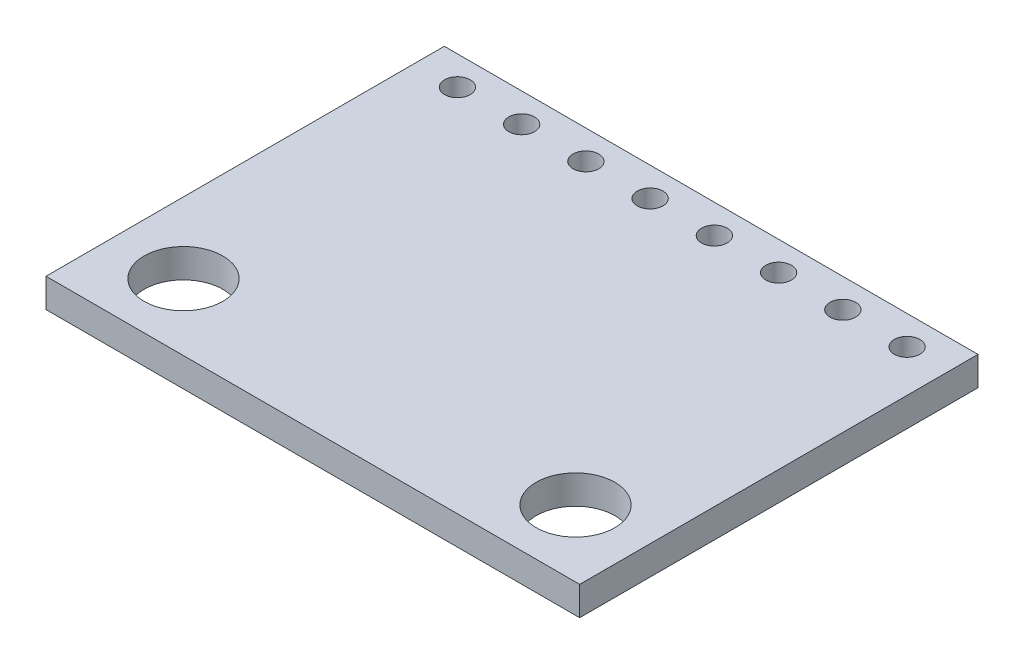
ISO-10303-21;
HEADER;
FILE_DESCRIPTION(('STEP AP214'),'2;1');
FILE_NAME('part.step','',(''),(''),'','','');
FILE_SCHEMA(('AUTOMOTIVE_DESIGN { 1 0 10303 214 1 1 1 1 }'));
ENDSEC;
DATA;
#1=APPLICATION_CONTEXT('core data for automotive mechanical design processes');
#2=APPLICATION_PROTOCOL_DEFINITION('international standard','automotive_design',2000,#1);
#3=PRODUCT_CONTEXT('',#1,'mechanical');
#4=PRODUCT('Part','Part','',(#3));
#5=PRODUCT_RELATED_PRODUCT_CATEGORY('part','',(#4));
#6=PRODUCT_DEFINITION_FORMATION('','',#4);
#7=PRODUCT_DEFINITION_CONTEXT('part definition',#1,'design');
#8=PRODUCT_DEFINITION('design','',#6,#7);
#9=PRODUCT_DEFINITION_SHAPE('','',#8);
#10=(LENGTH_UNIT() NAMED_UNIT(*) SI_UNIT(.MILLI.,.METRE.));
#11=(NAMED_UNIT(*) PLANE_ANGLE_UNIT() SI_UNIT($,.RADIAN.));
#12=(NAMED_UNIT(*) SI_UNIT($,.STERADIAN.) SOLID_ANGLE_UNIT());
#13=UNCERTAINTY_MEASURE_WITH_UNIT(LENGTH_MEASURE(1.E-05),#10,'distance_accuracy_value','');
#14=(GEOMETRIC_REPRESENTATION_CONTEXT(3) GLOBAL_UNCERTAINTY_ASSIGNED_CONTEXT((#13)) GLOBAL_UNIT_ASSIGNED_CONTEXT((#10,
#11,#12)) REPRESENTATION_CONTEXT('',''));
#15=CARTESIAN_POINT('',(0.,0.,0.));
#16=DIRECTION('',(0.,0.,1.));
#17=DIRECTION('',(1.,0.,0.));
#18=AXIS2_PLACEMENT_3D('',#15,#16,#17);
#19=CARTESIAN_POINT('',(0.,0.5715,0.));
#20=DIRECTION('',(0.,-1.,0.));
#21=DIRECTION('',(0.,0.,-1.));
#22=AXIS2_PLACEMENT_3D('',#19,#20,#21);
#23=PLANE('',#22);
#24=CARTESIAN_POINT('',(6.35,0.5715,-6.731));
#25=DIRECTION('',(0.,1.,0.));
#26=DIRECTION('',(0.,0.,1.));
#27=AXIS2_PLACEMENT_3D('',#24,#25,#26);
#28=CIRCLE('',#27,0.508);
#29=CARTESIAN_POINT('',(6.35,0.5715,-6.223));
#30=VERTEX_POINT('',#29);
#31=EDGE_CURVE('E160',#30,#30,#28,.T.);
#32=ORIENTED_EDGE('',*,*,#31,.F.);
#33=EDGE_LOOP('',(#32));
#34=FACE_BOUND('',#33,.T.);
#35=CARTESIAN_POINT('',(1.27,0.5715,-6.731));
#36=DIRECTION('',(0.,1.,0.));
#37=DIRECTION('',(0.,0.,1.));
#38=AXIS2_PLACEMENT_3D('',#35,#36,#37);
#39=CIRCLE('',#38,0.508);
#40=CARTESIAN_POINT('',(1.27,0.5715,-6.223));
#41=VERTEX_POINT('',#40);
#42=EDGE_CURVE('E148',#41,#41,#39,.T.);
#43=ORIENTED_EDGE('',*,*,#42,.F.);
#44=EDGE_LOOP('',(#43));
#45=FACE_BOUND('',#44,.T.);
#46=CARTESIAN_POINT('',(-3.81,0.5715,-6.731));
#47=DIRECTION('',(0.,1.,0.));
#48=DIRECTION('',(0.,0.,1.));
#49=AXIS2_PLACEMENT_3D('',#46,#47,#48);
#50=CIRCLE('',#49,0.508);
#51=CARTESIAN_POINT('',(-3.81,0.5715,-6.223));
#52=VERTEX_POINT('',#51);
#53=EDGE_CURVE('E136',#52,#52,#50,.T.);
#54=ORIENTED_EDGE('',*,*,#53,.F.);
#55=EDGE_LOOP('',(#54));
#56=FACE_BOUND('',#55,.T.);
#57=CARTESIAN_POINT('',(-8.89,0.5715,-6.731));
#58=DIRECTION('',(0.,1.,0.));
#59=DIRECTION('',(0.,0.,1.));
#60=AXIS2_PLACEMENT_3D('',#57,#58,#59);
#61=CIRCLE('',#60,0.508);
#62=CARTESIAN_POINT('',(-8.89,0.5715,-6.223));
#63=VERTEX_POINT('',#62);
#64=EDGE_CURVE('E124',#63,#63,#61,.T.);
#65=ORIENTED_EDGE('',*,*,#64,.F.);
#66=EDGE_LOOP('',(#65));
#67=FACE_BOUND('',#66,.T.);
#68=CARTESIAN_POINT('',(-7.75,0.5715,5.23875));
#69=DIRECTION('',(0.,1.,0.));
#70=DIRECTION('',(0.,0.,1.));
#71=AXIS2_PLACEMENT_3D('',#68,#69,#70);
#72=CIRCLE('',#71,1.55575);
#73=CARTESIAN_POINT('',(-7.75,0.5715,6.7945));
#74=VERTEX_POINT('',#73);
#75=EDGE_CURVE('E103',#74,#74,#72,.T.);
#76=ORIENTED_EDGE('',*,*,#75,.F.);
#77=EDGE_LOOP('',(#76));
#78=FACE_BOUND('',#77,.T.);
#79=DIRECTION('',(0.,0.,-1.));
#80=VECTOR('',#79,1.);
#81=CARTESIAN_POINT('',(10.55,0.5715,7.874));
#82=LINE('',#81,#80);
#83=CARTESIAN_POINT('',(10.55,0.5715,7.874));
#84=VERTEX_POINT('',#83);
#85=CARTESIAN_POINT('',(10.55,0.5715,-7.874));
#86=VERTEX_POINT('',#85);
#87=EDGE_CURVE('E88',#84,#86,#82,.T.);
#88=ORIENTED_EDGE('',*,*,#87,.T.);
#89=DIRECTION('',(-1.,0.,0.));
#90=VECTOR('',#89,1.);
#91=CARTESIAN_POINT('',(-10.55,0.5715,-7.874));
#92=LINE('',#91,#90);
#93=CARTESIAN_POINT('',(-10.55,0.5715,-7.874));
#94=VERTEX_POINT('',#93);
#95=EDGE_CURVE('E83',#86,#94,#92,.T.);
#96=ORIENTED_EDGE('',*,*,#95,.T.);
#97=DIRECTION('',(0.,0.,1.));
#98=VECTOR('',#97,1.);
#99=CARTESIAN_POINT('',(-10.55,0.5715,7.874));
#100=LINE('',#99,#98);
#101=CARTESIAN_POINT('',(-10.55,0.5715,7.874));
#102=VERTEX_POINT('',#101);
#103=EDGE_CURVE('E86',#94,#102,#100,.T.);
#104=ORIENTED_EDGE('',*,*,#103,.T.);
#105=DIRECTION('',(1.,0.,0.));
#106=VECTOR('',#105,1.);
#107=CARTESIAN_POINT('',(-10.55,0.5715,7.874));
#108=LINE('',#107,#106);
#109=EDGE_CURVE('E53',#102,#84,#108,.T.);
#110=ORIENTED_EDGE('',*,*,#109,.T.);
#111=EDGE_LOOP('',(#88,#96,#104,#110));
#112=FACE_BOUND('',#111,.T.);
#113=CARTESIAN_POINT('',(7.75,0.5715,5.23875));
#114=DIRECTION('',(0.,1.,0.));
#115=DIRECTION('',(0.,0.,-1.));
#116=AXIS2_PLACEMENT_3D('',#113,#114,#115);
#117=CIRCLE('',#116,1.55575);
#118=CARTESIAN_POINT('',(7.75,0.5715,3.683));
#119=VERTEX_POINT('',#118);
#120=EDGE_CURVE('E118',#119,#119,#117,.T.);
#121=ORIENTED_EDGE('',*,*,#120,.F.);
#122=EDGE_LOOP('',(#121));
#123=FACE_BOUND('',#122,.T.);
#124=CARTESIAN_POINT('',(-6.35,0.5715,-6.731));
#125=DIRECTION('',(0.,1.,0.));
#126=DIRECTION('',(0.,0.,1.));
#127=AXIS2_PLACEMENT_3D('',#124,#125,#126);
#128=CIRCLE('',#127,0.508);
#129=CARTESIAN_POINT('',(-6.35,0.5715,-6.223));
#130=VERTEX_POINT('',#129);
#131=EDGE_CURVE('E130',#130,#130,#128,.T.);
#132=ORIENTED_EDGE('',*,*,#131,.F.);
#133=EDGE_LOOP('',(#132));
#134=FACE_BOUND('',#133,.T.);
#135=CARTESIAN_POINT('',(-1.27,0.5715,-6.731));
#136=DIRECTION('',(0.,1.,0.));
#137=DIRECTION('',(0.,0.,1.));
#138=AXIS2_PLACEMENT_3D('',#135,#136,#137);
#139=CIRCLE('',#138,0.508);
#140=CARTESIAN_POINT('',(-1.27,0.5715,-6.223));
#141=VERTEX_POINT('',#140);
#142=EDGE_CURVE('E142',#141,#141,#139,.T.);
#143=ORIENTED_EDGE('',*,*,#142,.F.);
#144=EDGE_LOOP('',(#143));
#145=FACE_BOUND('',#144,.T.);
#146=CARTESIAN_POINT('',(3.81,0.5715,-6.731));
#147=DIRECTION('',(0.,1.,0.));
#148=DIRECTION('',(0.,0.,1.));
#149=AXIS2_PLACEMENT_3D('',#146,#147,#148);
#150=CIRCLE('',#149,0.508);
#151=CARTESIAN_POINT('',(3.81,0.5715,-6.223));
#152=VERTEX_POINT('',#151);
#153=EDGE_CURVE('E154',#152,#152,#150,.T.);
#154=ORIENTED_EDGE('',*,*,#153,.F.);
#155=EDGE_LOOP('',(#154));
#156=FACE_BOUND('',#155,.T.);
#157=CARTESIAN_POINT('',(8.89,0.5715,-6.731));
#158=DIRECTION('',(0.,1.,0.));
#159=DIRECTION('',(0.,0.,1.));
#160=AXIS2_PLACEMENT_3D('',#157,#158,#159);
#161=CIRCLE('',#160,0.508);
#162=CARTESIAN_POINT('',(8.89,0.5715,-6.223));
#163=VERTEX_POINT('',#162);
#164=EDGE_CURVE('E166',#163,#163,#161,.T.);
#165=ORIENTED_EDGE('',*,*,#164,.F.);
#166=EDGE_LOOP('',(#165));
#167=FACE_BOUND('',#166,.T.);
#168=ADVANCED_FACE('F36',(#34,#45,#56,#67,#78,#112,#123,#134,#145,#156,#167),#23,.F.);
#169=CARTESIAN_POINT('',(0.,-0.5715,0.));
#170=DIRECTION('',(0.,-1.,0.));
#171=DIRECTION('',(0.,0.,-1.));
#172=AXIS2_PLACEMENT_3D('',#169,#170,#171);
#173=PLANE('',#172);
#174=CARTESIAN_POINT('',(6.35,-0.5715,-6.731));
#175=DIRECTION('',(0.,1.,0.));
#176=DIRECTION('',(0.,0.,1.));
#177=AXIS2_PLACEMENT_3D('',#174,#175,#176);
#178=CIRCLE('',#177,0.508);
#179=CARTESIAN_POINT('',(6.35,-0.5715,-6.223));
#180=VERTEX_POINT('',#179);
#181=EDGE_CURVE('E163',#180,#180,#178,.T.);
#182=ORIENTED_EDGE('',*,*,#181,.T.);
#183=EDGE_LOOP('',(#182));
#184=FACE_BOUND('',#183,.T.);
#185=CARTESIAN_POINT('',(1.27,-0.5715,-6.731));
#186=DIRECTION('',(0.,1.,0.));
#187=DIRECTION('',(0.,0.,1.));
#188=AXIS2_PLACEMENT_3D('',#185,#186,#187);
#189=CIRCLE('',#188,0.508);
#190=CARTESIAN_POINT('',(1.27,-0.5715,-6.223));
#191=VERTEX_POINT('',#190);
#192=EDGE_CURVE('E151',#191,#191,#189,.T.);
#193=ORIENTED_EDGE('',*,*,#192,.T.);
#194=EDGE_LOOP('',(#193));
#195=FACE_BOUND('',#194,.T.);
#196=CARTESIAN_POINT('',(-3.81,-0.5715,-6.731));
#197=DIRECTION('',(0.,1.,0.));
#198=DIRECTION('',(0.,0.,1.));
#199=AXIS2_PLACEMENT_3D('',#196,#197,#198);
#200=CIRCLE('',#199,0.508);
#201=CARTESIAN_POINT('',(-3.81,-0.5715,-6.223));
#202=VERTEX_POINT('',#201);
#203=EDGE_CURVE('E139',#202,#202,#200,.T.);
#204=ORIENTED_EDGE('',*,*,#203,.T.);
#205=EDGE_LOOP('',(#204));
#206=FACE_BOUND('',#205,.T.);
#207=CARTESIAN_POINT('',(-8.89,-0.5715,-6.731));
#208=DIRECTION('',(0.,1.,0.));
#209=DIRECTION('',(0.,0.,1.));
#210=AXIS2_PLACEMENT_3D('',#207,#208,#209);
#211=CIRCLE('',#210,0.508);
#212=CARTESIAN_POINT('',(-8.89,-0.5715,-6.223));
#213=VERTEX_POINT('',#212);
#214=EDGE_CURVE('E127',#213,#213,#211,.T.);
#215=ORIENTED_EDGE('',*,*,#214,.T.);
#216=EDGE_LOOP('',(#215));
#217=FACE_BOUND('',#216,.T.);
#218=CARTESIAN_POINT('',(-7.75,-0.5715,5.23875));
#219=DIRECTION('',(0.,1.,0.));
#220=DIRECTION('',(0.,0.,1.));
#221=AXIS2_PLACEMENT_3D('',#218,#219,#220);
#222=CIRCLE('',#221,1.55575);
#223=CARTESIAN_POINT('',(-7.75,-0.5715,6.7945));
#224=VERTEX_POINT('',#223);
#225=EDGE_CURVE('E115',#224,#224,#222,.T.);
#226=ORIENTED_EDGE('',*,*,#225,.T.);
#227=EDGE_LOOP('',(#226));
#228=FACE_BOUND('',#227,.T.);
#229=DIRECTION('',(0.,0.,-1.));
#230=VECTOR('',#229,1.);
#231=CARTESIAN_POINT('',(10.55,-0.5715,7.874));
#232=LINE('',#231,#230);
#233=CARTESIAN_POINT('',(10.55,-0.5715,7.874));
#234=VERTEX_POINT('',#233);
#235=CARTESIAN_POINT('',(10.55,-0.5715,-7.874));
#236=VERTEX_POINT('',#235);
#237=EDGE_CURVE('E100',#234,#236,#232,.T.);
#238=ORIENTED_EDGE('',*,*,#237,.F.);
#239=DIRECTION('',(1.,0.,0.));
#240=VECTOR('',#239,1.);
#241=CARTESIAN_POINT('',(-10.55,-0.5715,7.874));
#242=LINE('',#241,#240);
#243=CARTESIAN_POINT('',(-10.55,-0.5715,7.874));
#244=VERTEX_POINT('',#243);
#245=EDGE_CURVE('E76',#244,#234,#242,.T.);
#246=ORIENTED_EDGE('',*,*,#245,.F.);
#247=DIRECTION('',(0.,0.,1.));
#248=VECTOR('',#247,1.);
#249=CARTESIAN_POINT('',(-10.55,-0.5715,7.874));
#250=LINE('',#249,#248);
#251=CARTESIAN_POINT('',(-10.55,-0.5715,-7.874));
#252=VERTEX_POINT('',#251);
#253=EDGE_CURVE('E70',#252,#244,#250,.T.);
#254=ORIENTED_EDGE('',*,*,#253,.F.);
#255=DIRECTION('',(-1.,0.,0.));
#256=VECTOR('',#255,1.);
#257=CARTESIAN_POINT('',(-10.55,-0.5715,-7.874));
#258=LINE('',#257,#256);
#259=EDGE_CURVE('E92',#236,#252,#258,.T.);
#260=ORIENTED_EDGE('',*,*,#259,.F.);
#261=EDGE_LOOP('',(#238,#246,#254,#260));
#262=FACE_BOUND('',#261,.T.);
#263=CARTESIAN_POINT('',(7.75,-0.5715,5.23875));
#264=DIRECTION('',(0.,1.,0.));
#265=DIRECTION('',(0.,0.,-1.));
#266=AXIS2_PLACEMENT_3D('',#263,#264,#265);
#267=CIRCLE('',#266,1.55575);
#268=CARTESIAN_POINT('',(7.75,-0.5715,3.683));
#269=VERTEX_POINT('',#268);
#270=EDGE_CURVE('E121',#269,#269,#267,.T.);
#271=ORIENTED_EDGE('',*,*,#270,.T.);
#272=EDGE_LOOP('',(#271));
#273=FACE_BOUND('',#272,.T.);
#274=CARTESIAN_POINT('',(-6.35,-0.5715,-6.731));
#275=DIRECTION('',(0.,1.,0.));
#276=DIRECTION('',(0.,0.,1.));
#277=AXIS2_PLACEMENT_3D('',#274,#275,#276);
#278=CIRCLE('',#277,0.508);
#279=CARTESIAN_POINT('',(-6.35,-0.5715,-6.223));
#280=VERTEX_POINT('',#279);
#281=EDGE_CURVE('E133',#280,#280,#278,.T.);
#282=ORIENTED_EDGE('',*,*,#281,.T.);
#283=EDGE_LOOP('',(#282));
#284=FACE_BOUND('',#283,.T.);
#285=CARTESIAN_POINT('',(-1.27,-0.5715,-6.731));
#286=DIRECTION('',(0.,1.,0.));
#287=DIRECTION('',(0.,0.,1.));
#288=AXIS2_PLACEMENT_3D('',#285,#286,#287);
#289=CIRCLE('',#288,0.508);
#290=CARTESIAN_POINT('',(-1.27,-0.5715,-6.223));
#291=VERTEX_POINT('',#290);
#292=EDGE_CURVE('E145',#291,#291,#289,.T.);
#293=ORIENTED_EDGE('',*,*,#292,.T.);
#294=EDGE_LOOP('',(#293));
#295=FACE_BOUND('',#294,.T.);
#296=CARTESIAN_POINT('',(3.81,-0.5715,-6.731));
#297=DIRECTION('',(0.,1.,0.));
#298=DIRECTION('',(0.,0.,1.));
#299=AXIS2_PLACEMENT_3D('',#296,#297,#298);
#300=CIRCLE('',#299,0.508);
#301=CARTESIAN_POINT('',(3.81,-0.5715,-6.223));
#302=VERTEX_POINT('',#301);
#303=EDGE_CURVE('E157',#302,#302,#300,.T.);
#304=ORIENTED_EDGE('',*,*,#303,.T.);
#305=EDGE_LOOP('',(#304));
#306=FACE_BOUND('',#305,.T.);
#307=CARTESIAN_POINT('',(8.89,-0.5715,-6.731));
#308=DIRECTION('',(0.,1.,0.));
#309=DIRECTION('',(0.,0.,1.));
#310=AXIS2_PLACEMENT_3D('',#307,#308,#309);
#311=CIRCLE('',#310,0.508);
#312=CARTESIAN_POINT('',(8.89,-0.5715,-6.223));
#313=VERTEX_POINT('',#312);
#314=EDGE_CURVE('E169',#313,#313,#311,.T.);
#315=ORIENTED_EDGE('',*,*,#314,.T.);
#316=EDGE_LOOP('',(#315));
#317=FACE_BOUND('',#316,.T.);
#318=ADVANCED_FACE('F111',(#184,#195,#206,#217,#228,#262,#273,#284,#295,#306,#317),#173,.T.);
#319=CARTESIAN_POINT('',(10.55,0.5715,7.874));
#320=DIRECTION('',(-1.,0.,0.));
#321=DIRECTION('',(0.,0.,1.));
#322=AXIS2_PLACEMENT_3D('',#319,#320,#321);
#323=PLANE('',#322);
#324=ORIENTED_EDGE('',*,*,#237,.T.);
#325=DIRECTION('',(0.,-1.,0.));
#326=VECTOR('',#325,1.);
#327=CARTESIAN_POINT('',(10.55,0.5715,-7.874));
#328=LINE('',#327,#326);
#329=EDGE_CURVE('E11',#86,#236,#328,.T.);
#330=ORIENTED_EDGE('',*,*,#329,.F.);
#331=ORIENTED_EDGE('',*,*,#87,.F.);
#332=DIRECTION('',(0.,-1.,0.));
#333=VECTOR('',#332,1.);
#334=CARTESIAN_POINT('',(10.55,0.5715,7.874));
#335=LINE('',#334,#333);
#336=EDGE_CURVE('E96',#84,#234,#335,.T.);
#337=ORIENTED_EDGE('',*,*,#336,.T.);
#338=EDGE_LOOP('',(#324,#330,#331,#337));
#339=FACE_BOUND('',#338,.T.);
#340=ADVANCED_FACE('F38',(#339),#323,.F.);
#341=CARTESIAN_POINT('',(-10.55,0.5715,-7.874));
#342=DIRECTION('',(0.,0.,1.));
#343=DIRECTION('',(1.,0.,0.));
#344=AXIS2_PLACEMENT_3D('',#341,#342,#343);
#345=PLANE('',#344);
#346=ORIENTED_EDGE('',*,*,#259,.T.);
#347=DIRECTION('',(0.,-1.,0.));
#348=VECTOR('',#347,1.);
#349=CARTESIAN_POINT('',(-10.55,0.5715,-7.874));
#350=LINE('',#349,#348);
#351=EDGE_CURVE('E45',#94,#252,#350,.T.);
#352=ORIENTED_EDGE('',*,*,#351,.F.);
#353=ORIENTED_EDGE('',*,*,#95,.F.);
#354=ORIENTED_EDGE('',*,*,#329,.T.);
#355=EDGE_LOOP('',(#346,#352,#353,#354));
#356=FACE_BOUND('',#355,.T.);
#357=ADVANCED_FACE('F91',(#356),#345,.F.);
#358=CARTESIAN_POINT('',(-10.55,0.5715,7.874));
#359=DIRECTION('',(1.,0.,0.));
#360=DIRECTION('',(0.,0.,-1.));
#361=AXIS2_PLACEMENT_3D('',#358,#359,#360);
#362=PLANE('',#361);
#363=ORIENTED_EDGE('',*,*,#253,.T.);
#364=DIRECTION('',(0.,-1.,0.));
#365=VECTOR('',#364,1.);
#366=CARTESIAN_POINT('',(-10.55,0.5715,7.874));
#367=LINE('',#366,#365);
#368=EDGE_CURVE('E93',#102,#244,#367,.T.);
#369=ORIENTED_EDGE('',*,*,#368,.F.);
#370=ORIENTED_EDGE('',*,*,#103,.F.);
#371=ORIENTED_EDGE('',*,*,#351,.T.);
#372=EDGE_LOOP('',(#363,#369,#370,#371));
#373=FACE_BOUND('',#372,.T.);
#374=ADVANCED_FACE('F94',(#373),#362,.F.);
#375=CARTESIAN_POINT('',(-10.55,0.5715,7.874));
#376=DIRECTION('',(0.,0.,-1.));
#377=DIRECTION('',(-1.,0.,0.));
#378=AXIS2_PLACEMENT_3D('',#375,#376,#377);
#379=PLANE('',#378);
#380=ORIENTED_EDGE('',*,*,#245,.T.);
#381=ORIENTED_EDGE('',*,*,#336,.F.);
#382=ORIENTED_EDGE('',*,*,#109,.F.);
#383=ORIENTED_EDGE('',*,*,#368,.T.);
#384=EDGE_LOOP('',(#380,#381,#382,#383));
#385=FACE_BOUND('',#384,.T.);
#386=ADVANCED_FACE('F108',(#385),#379,.F.);
#387=CARTESIAN_POINT('',(-7.75,0.5715,5.23875));
#388=DIRECTION('',(0.,-1.,0.));
#389=DIRECTION('',(0.,0.,-1.));
#390=AXIS2_PLACEMENT_3D('',#387,#388,#389);
#391=CYLINDRICAL_SURFACE('',#390,1.55575);
#392=ORIENTED_EDGE('',*,*,#75,.T.);
#393=EDGE_LOOP('',(#392));
#394=FACE_BOUND('',#393,.T.);
#395=ORIENTED_EDGE('',*,*,#225,.F.);
#396=EDGE_LOOP('',(#395));
#397=FACE_BOUND('',#396,.T.);
#398=ADVANCED_FACE('F189',(#394,#397),#391,.F.);
#399=CARTESIAN_POINT('',(7.75,0.5715,5.23875));
#400=DIRECTION('',(0.,-1.,0.));
#401=DIRECTION('',(0.,0.,-1.));
#402=AXIS2_PLACEMENT_3D('',#399,#400,#401);
#403=CYLINDRICAL_SURFACE('',#402,1.55575);
#404=ORIENTED_EDGE('',*,*,#120,.T.);
#405=EDGE_LOOP('',(#404));
#406=FACE_BOUND('',#405,.T.);
#407=ORIENTED_EDGE('',*,*,#270,.F.);
#408=EDGE_LOOP('',(#407));
#409=FACE_BOUND('',#408,.T.);
#410=ADVANCED_FACE('F213',(#406,#409),#403,.F.);
#411=CARTESIAN_POINT('',(-8.89,0.5715,-6.731));
#412=DIRECTION('',(0.,-1.,0.));
#413=DIRECTION('',(0.,0.,-1.));
#414=AXIS2_PLACEMENT_3D('',#411,#412,#413);
#415=CYLINDRICAL_SURFACE('',#414,0.508);
#416=ORIENTED_EDGE('',*,*,#64,.T.);
#417=EDGE_LOOP('',(#416));
#418=FACE_BOUND('',#417,.T.);
#419=ORIENTED_EDGE('',*,*,#214,.F.);
#420=EDGE_LOOP('',(#419));
#421=FACE_BOUND('',#420,.T.);
#422=ADVANCED_FACE('F218',(#418,#421),#415,.F.);
#423=CARTESIAN_POINT('',(-6.35,0.5715,-6.731));
#424=DIRECTION('',(0.,-1.,0.));
#425=DIRECTION('',(0.,0.,-1.));
#426=AXIS2_PLACEMENT_3D('',#423,#424,#425);
#427=CYLINDRICAL_SURFACE('',#426,0.508);
#428=ORIENTED_EDGE('',*,*,#131,.T.);
#429=EDGE_LOOP('',(#428));
#430=FACE_BOUND('',#429,.T.);
#431=ORIENTED_EDGE('',*,*,#281,.F.);
#432=EDGE_LOOP('',(#431));
#433=FACE_BOUND('',#432,.T.);
#434=ADVANCED_FACE('F236',(#430,#433),#427,.F.);
#435=CARTESIAN_POINT('',(-3.81,0.5715,-6.731));
#436=DIRECTION('',(0.,-1.,0.));
#437=DIRECTION('',(0.,0.,-1.));
#438=AXIS2_PLACEMENT_3D('',#435,#436,#437);
#439=CYLINDRICAL_SURFACE('',#438,0.508);
#440=ORIENTED_EDGE('',*,*,#53,.T.);
#441=EDGE_LOOP('',(#440));
#442=FACE_BOUND('',#441,.T.);
#443=ORIENTED_EDGE('',*,*,#203,.F.);
#444=EDGE_LOOP('',(#443));
#445=FACE_BOUND('',#444,.T.);
#446=ADVANCED_FACE('F246',(#442,#445),#439,.F.);
#447=CARTESIAN_POINT('',(-1.27,0.5715,-6.731));
#448=DIRECTION('',(0.,-1.,0.));
#449=DIRECTION('',(0.,0.,-1.));
#450=AXIS2_PLACEMENT_3D('',#447,#448,#449);
#451=CYLINDRICAL_SURFACE('',#450,0.508);
#452=ORIENTED_EDGE('',*,*,#142,.T.);
#453=EDGE_LOOP('',(#452));
#454=FACE_BOUND('',#453,.T.);
#455=ORIENTED_EDGE('',*,*,#292,.F.);
#456=EDGE_LOOP('',(#455));
#457=FACE_BOUND('',#456,.T.);
#458=ADVANCED_FACE('F256',(#454,#457),#451,.F.);
#459=CARTESIAN_POINT('',(1.27,0.5715,-6.731));
#460=DIRECTION('',(0.,-1.,0.));
#461=DIRECTION('',(0.,0.,-1.));
#462=AXIS2_PLACEMENT_3D('',#459,#460,#461);
#463=CYLINDRICAL_SURFACE('',#462,0.508);
#464=ORIENTED_EDGE('',*,*,#42,.T.);
#465=EDGE_LOOP('',(#464));
#466=FACE_BOUND('',#465,.T.);
#467=ORIENTED_EDGE('',*,*,#192,.F.);
#468=EDGE_LOOP('',(#467));
#469=FACE_BOUND('',#468,.T.);
#470=ADVANCED_FACE('F266',(#466,#469),#463,.F.);
#471=CARTESIAN_POINT('',(3.81,0.5715,-6.731));
#472=DIRECTION('',(0.,-1.,0.));
#473=DIRECTION('',(0.,0.,-1.));
#474=AXIS2_PLACEMENT_3D('',#471,#472,#473);
#475=CYLINDRICAL_SURFACE('',#474,0.508);
#476=ORIENTED_EDGE('',*,*,#153,.T.);
#477=EDGE_LOOP('',(#476));
#478=FACE_BOUND('',#477,.T.);
#479=ORIENTED_EDGE('',*,*,#303,.F.);
#480=EDGE_LOOP('',(#479));
#481=FACE_BOUND('',#480,.T.);
#482=ADVANCED_FACE('F276',(#478,#481),#475,.F.);
#483=CARTESIAN_POINT('',(6.35,0.5715,-6.731));
#484=DIRECTION('',(0.,-1.,0.));
#485=DIRECTION('',(0.,0.,-1.));
#486=AXIS2_PLACEMENT_3D('',#483,#484,#485);
#487=CYLINDRICAL_SURFACE('',#486,0.508);
#488=ORIENTED_EDGE('',*,*,#31,.T.);
#489=EDGE_LOOP('',(#488));
#490=FACE_BOUND('',#489,.T.);
#491=ORIENTED_EDGE('',*,*,#181,.F.);
#492=EDGE_LOOP('',(#491));
#493=FACE_BOUND('',#492,.T.);
#494=ADVANCED_FACE('F286',(#490,#493),#487,.F.);
#495=CARTESIAN_POINT('',(8.89,0.5715,-6.731));
#496=DIRECTION('',(0.,-1.,0.));
#497=DIRECTION('',(0.,0.,-1.));
#498=AXIS2_PLACEMENT_3D('',#495,#496,#497);
#499=CYLINDRICAL_SURFACE('',#498,0.508);
#500=ORIENTED_EDGE('',*,*,#164,.T.);
#501=EDGE_LOOP('',(#500));
#502=FACE_BOUND('',#501,.T.);
#503=ORIENTED_EDGE('',*,*,#314,.F.);
#504=EDGE_LOOP('',(#503));
#505=FACE_BOUND('',#504,.T.);
#506=ADVANCED_FACE('F175',(#502,#505),#499,.F.);
#507=CLOSED_SHELL('',(#168,#318,#340,#357,#374,#386,#398,#410,#422,#434,#446,#458,#470,#482,
#494,#506));
#508=MANIFOLD_SOLID_BREP('B2',#507);
#509=ADVANCED_BREP_SHAPE_REPRESENTATION('',(#18,#508),#14);
#510=SHAPE_DEFINITION_REPRESENTATION(#9,#509);
ENDSEC;
END-ISO-10303-21;
